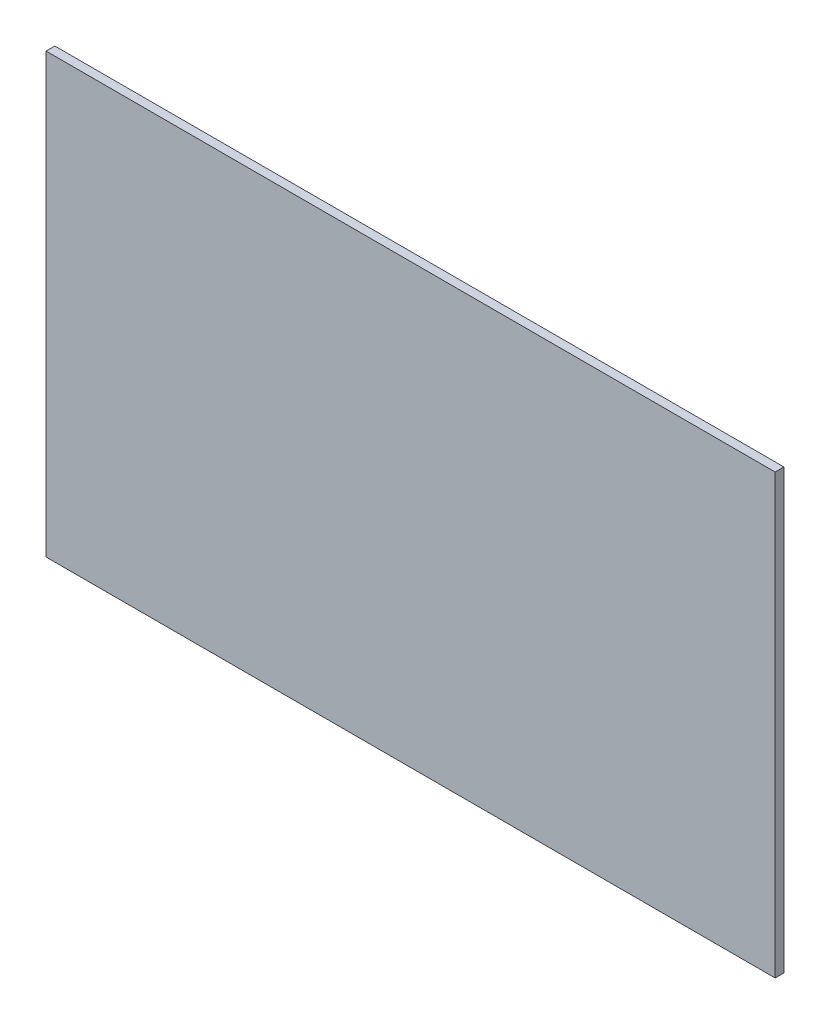
ISO-10303-21;
HEADER;
FILE_DESCRIPTION(('STEP AP214'),'2;1');
FILE_NAME('part.step','',(''),(''),'','','');
FILE_SCHEMA(('AUTOMOTIVE_DESIGN { 1 0 10303 214 1 1 1 1 }'));
ENDSEC;
DATA;
#1=APPLICATION_CONTEXT('core data for automotive mechanical design processes');
#2=APPLICATION_PROTOCOL_DEFINITION('international standard','automotive_design',2000,#1);
#3=PRODUCT_CONTEXT('',#1,'mechanical');
#4=PRODUCT('Part','Part','',(#3));
#5=PRODUCT_RELATED_PRODUCT_CATEGORY('part','',(#4));
#6=PRODUCT_DEFINITION_FORMATION('','',#4);
#7=PRODUCT_DEFINITION_CONTEXT('part definition',#1,'design');
#8=PRODUCT_DEFINITION('design','',#6,#7);
#9=PRODUCT_DEFINITION_SHAPE('','',#8);
#10=(LENGTH_UNIT() NAMED_UNIT(*) SI_UNIT(.MILLI.,.METRE.));
#11=(NAMED_UNIT(*) PLANE_ANGLE_UNIT() SI_UNIT($,.RADIAN.));
#12=(NAMED_UNIT(*) SI_UNIT($,.STERADIAN.) SOLID_ANGLE_UNIT());
#13=UNCERTAINTY_MEASURE_WITH_UNIT(LENGTH_MEASURE(1.E-05),#10,'distance_accuracy_value','');
#14=(GEOMETRIC_REPRESENTATION_CONTEXT(3) GLOBAL_UNCERTAINTY_ASSIGNED_CONTEXT((#13)) GLOBAL_UNIT_ASSIGNED_CONTEXT((#10,
#11,#12)) REPRESENTATION_CONTEXT('',''));
#15=CARTESIAN_POINT('',(0.,0.,0.));
#16=DIRECTION('',(0.,0.,1.));
#17=DIRECTION('',(1.,0.,0.));
#18=AXIS2_PLACEMENT_3D('',#15,#16,#17);
#19=CARTESIAN_POINT('',(0.,0.,3.));
#20=DIRECTION('',(1.,0.,0.));
#21=DIRECTION('',(0.,0.,-1.));
#22=AXIS2_PLACEMENT_3D('',#19,#20,#21);
#23=PLANE('',#22);
#24=DIRECTION('',(0.,-1.,0.));
#25=VECTOR('',#24,1.);
#26=CARTESIAN_POINT('',(0.,0.,0.));
#27=LINE('',#26,#25);
#28=CARTESIAN_POINT('',(0.,0.,0.));
#29=VERTEX_POINT('',#28);
#30=CARTESIAN_POINT('',(0.,-150.,0.));
#31=VERTEX_POINT('',#30);
#32=EDGE_CURVE('E96',#29,#31,#27,.T.);
#33=ORIENTED_EDGE('',*,*,#32,.T.);
#34=DIRECTION('',(0.,0.,-1.));
#35=VECTOR('',#34,1.);
#36=CARTESIAN_POINT('',(0.,-150.,3.));
#37=LINE('',#36,#35);
#38=CARTESIAN_POINT('',(0.,-150.,3.));
#39=VERTEX_POINT('',#38);
#40=EDGE_CURVE('E11',#39,#31,#37,.T.);
#41=ORIENTED_EDGE('',*,*,#40,.F.);
#42=DIRECTION('',(0.,-1.,0.));
#43=VECTOR('',#42,1.);
#44=CARTESIAN_POINT('',(0.,0.,3.));
#45=LINE('',#44,#43);
#46=CARTESIAN_POINT('',(0.,0.,3.));
#47=VERTEX_POINT('',#46);
#48=EDGE_CURVE('E84',#47,#39,#45,.T.);
#49=ORIENTED_EDGE('',*,*,#48,.F.);
#50=DIRECTION('',(0.,0.,-1.));
#51=VECTOR('',#50,1.);
#52=CARTESIAN_POINT('',(0.,0.,3.));
#53=LINE('',#52,#51);
#54=EDGE_CURVE('E92',#47,#29,#53,.T.);
#55=ORIENTED_EDGE('',*,*,#54,.T.);
#56=EDGE_LOOP('',(#33,#41,#49,#55));
#57=FACE_BOUND('',#56,.T.);
#58=ADVANCED_FACE('F33',(#57),#23,.F.);
#59=CARTESIAN_POINT('',(0.,-150.,3.));
#60=DIRECTION('',(0.,1.,0.));
#61=DIRECTION('',(0.,0.,1.));
#62=AXIS2_PLACEMENT_3D('',#59,#60,#61);
#63=PLANE('',#62);
#64=DIRECTION('',(1.,0.,0.));
#65=VECTOR('',#64,1.);
#66=CARTESIAN_POINT('',(0.,-150.,0.));
#67=LINE('',#66,#65);
#68=CARTESIAN_POINT('',(249.6,-150.,0.));
#69=VERTEX_POINT('',#68);
#70=EDGE_CURVE('E88',#31,#69,#67,.T.);
#71=ORIENTED_EDGE('',*,*,#70,.T.);
#72=DIRECTION('',(0.,0.,-1.));
#73=VECTOR('',#72,1.);
#74=CARTESIAN_POINT('',(249.6,-150.,3.));
#75=LINE('',#74,#73);
#76=CARTESIAN_POINT('',(249.6,-150.,3.));
#77=VERTEX_POINT('',#76);
#78=EDGE_CURVE('E41',#77,#69,#75,.T.);
#79=ORIENTED_EDGE('',*,*,#78,.F.);
#80=DIRECTION('',(1.,0.,0.));
#81=VECTOR('',#80,1.);
#82=CARTESIAN_POINT('',(0.,-150.,3.));
#83=LINE('',#82,#81);
#84=EDGE_CURVE('E79',#39,#77,#83,.T.);
#85=ORIENTED_EDGE('',*,*,#84,.F.);
#86=ORIENTED_EDGE('',*,*,#40,.T.);
#87=EDGE_LOOP('',(#71,#79,#85,#86));
#88=FACE_BOUND('',#87,.T.);
#89=ADVANCED_FACE('F87',(#88),#63,.F.);
#90=CARTESIAN_POINT('',(249.6,0.,3.));
#91=DIRECTION('',(-1.,0.,0.));
#92=DIRECTION('',(0.,-1.,0.));
#93=AXIS2_PLACEMENT_3D('',#90,#91,#92);
#94=PLANE('',#93);
#95=DIRECTION('',(0.,1.,0.));
#96=VECTOR('',#95,1.);
#97=CARTESIAN_POINT('',(249.6,0.,0.));
#98=LINE('',#97,#96);
#99=CARTESIAN_POINT('',(249.6,0.,0.));
#100=VERTEX_POINT('',#99);
#101=EDGE_CURVE('E66',#69,#100,#98,.T.);
#102=ORIENTED_EDGE('',*,*,#101,.T.);
#103=DIRECTION('',(0.,0.,-1.));
#104=VECTOR('',#103,1.);
#105=CARTESIAN_POINT('',(249.6,0.,3.));
#106=LINE('',#105,#104);
#107=CARTESIAN_POINT('',(249.6,0.,3.));
#108=VERTEX_POINT('',#107);
#109=EDGE_CURVE('E89',#108,#100,#106,.T.);
#110=ORIENTED_EDGE('',*,*,#109,.F.);
#111=DIRECTION('',(0.,1.,0.));
#112=VECTOR('',#111,1.);
#113=CARTESIAN_POINT('',(249.6,0.,3.));
#114=LINE('',#113,#112);
#115=EDGE_CURVE('E82',#77,#108,#114,.T.);
#116=ORIENTED_EDGE('',*,*,#115,.F.);
#117=ORIENTED_EDGE('',*,*,#78,.T.);
#118=EDGE_LOOP('',(#102,#110,#116,#117));
#119=FACE_BOUND('',#118,.T.);
#120=ADVANCED_FACE('F90',(#119),#94,.F.);
#121=CARTESIAN_POINT('',(0.,0.,3.));
#122=DIRECTION('',(0.,-1.,0.));
#123=DIRECTION('',(0.,0.,-1.));
#124=AXIS2_PLACEMENT_3D('',#121,#122,#123);
#125=PLANE('',#124);
#126=DIRECTION('',(-1.,0.,0.));
#127=VECTOR('',#126,1.);
#128=CARTESIAN_POINT('',(0.,0.,0.));
#129=LINE('',#128,#127);
#130=EDGE_CURVE('E72',#100,#29,#129,.T.);
#131=ORIENTED_EDGE('',*,*,#130,.T.);
#132=ORIENTED_EDGE('',*,*,#54,.F.);
#133=DIRECTION('',(-1.,0.,0.));
#134=VECTOR('',#133,1.);
#135=CARTESIAN_POINT('',(0.,0.,3.));
#136=LINE('',#135,#134);
#137=EDGE_CURVE('E49',#108,#47,#136,.T.);
#138=ORIENTED_EDGE('',*,*,#137,.F.);
#139=ORIENTED_EDGE('',*,*,#109,.T.);
#140=EDGE_LOOP('',(#131,#132,#138,#139));
#141=FACE_BOUND('',#140,.T.);
#142=ADVANCED_FACE('F103',(#141),#125,.F.);
#143=CARTESIAN_POINT('',(0.,0.,3.));
#144=DIRECTION('',(0.,0.,1.));
#145=DIRECTION('',(1.,0.,0.));
#146=AXIS2_PLACEMENT_3D('',#143,#144,#145);
#147=PLANE('',#146);
#148=ORIENTED_EDGE('',*,*,#48,.T.);
#149=ORIENTED_EDGE('',*,*,#84,.T.);
#150=ORIENTED_EDGE('',*,*,#115,.T.);
#151=ORIENTED_EDGE('',*,*,#137,.T.);
#152=EDGE_LOOP('',(#148,#149,#150,#151));
#153=FACE_BOUND('',#152,.T.);
#154=ADVANCED_FACE('F80',(#153),#147,.T.);
#155=CARTESIAN_POINT('',(0.,0.,0.));
#156=DIRECTION('',(0.,0.,1.));
#157=DIRECTION('',(1.,0.,0.));
#158=AXIS2_PLACEMENT_3D('',#155,#156,#157);
#159=PLANE('',#158);
#160=ORIENTED_EDGE('',*,*,#32,.F.);
#161=ORIENTED_EDGE('',*,*,#130,.F.);
#162=ORIENTED_EDGE('',*,*,#101,.F.);
#163=ORIENTED_EDGE('',*,*,#70,.F.);
#164=EDGE_LOOP('',(#160,#161,#162,#163));
#165=FACE_BOUND('',#164,.T.);
#166=ADVANCED_FACE('F106',(#165),#159,.F.);
#167=CLOSED_SHELL('',(#58,#89,#120,#142,#154,#166));
#168=MANIFOLD_SOLID_BREP('B2',#167);
#169=ADVANCED_BREP_SHAPE_REPRESENTATION('',(#18,#168),#14);
#170=SHAPE_DEFINITION_REPRESENTATION(#9,#169);
ENDSEC;
END-ISO-10303-21;
